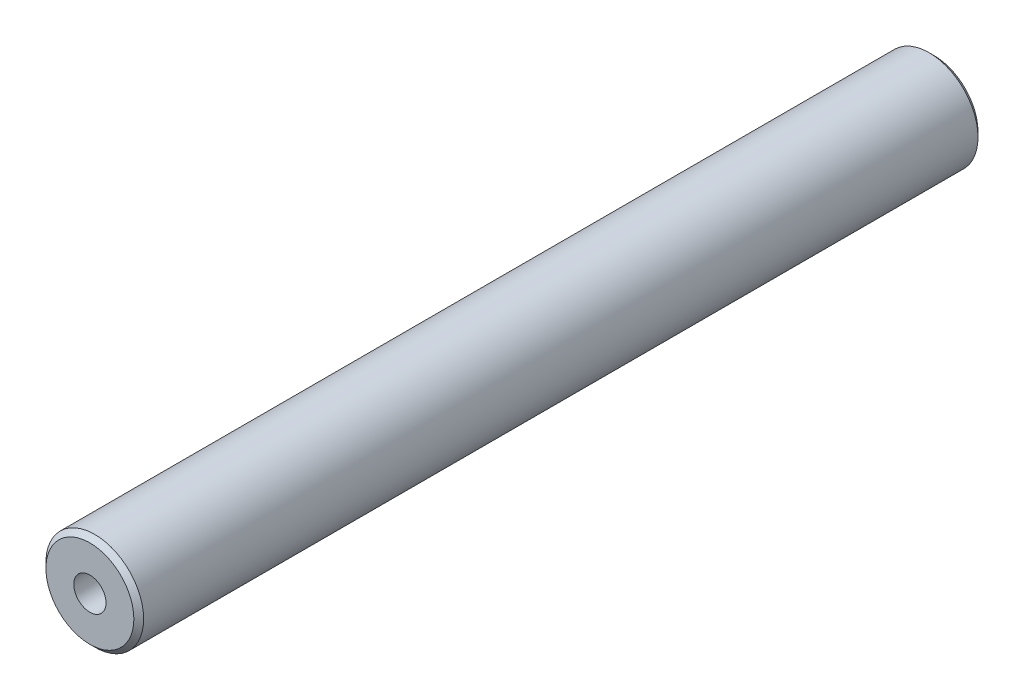
ISO-10303-21;
HEADER;
FILE_DESCRIPTION(('STEP AP214'),'2;1');
FILE_NAME('part.step','',(''),(''),'','','');
FILE_SCHEMA(('AUTOMOTIVE_DESIGN { 1 0 10303 214 1 1 1 1 }'));
ENDSEC;
DATA;
#1=APPLICATION_CONTEXT('core data for automotive mechanical design processes');
#2=APPLICATION_PROTOCOL_DEFINITION('international standard','automotive_design',2000,#1);
#3=PRODUCT_CONTEXT('',#1,'mechanical');
#4=PRODUCT('Part','Part','',(#3));
#5=PRODUCT_RELATED_PRODUCT_CATEGORY('part','',(#4));
#6=PRODUCT_DEFINITION_FORMATION('','',#4);
#7=PRODUCT_DEFINITION_CONTEXT('part definition',#1,'design');
#8=PRODUCT_DEFINITION('design','',#6,#7);
#9=PRODUCT_DEFINITION_SHAPE('','',#8);
#10=(LENGTH_UNIT() NAMED_UNIT(*) SI_UNIT(.MILLI.,.METRE.));
#11=(NAMED_UNIT(*) PLANE_ANGLE_UNIT() SI_UNIT($,.RADIAN.));
#12=(NAMED_UNIT(*) SI_UNIT($,.STERADIAN.) SOLID_ANGLE_UNIT());
#13=UNCERTAINTY_MEASURE_WITH_UNIT(LENGTH_MEASURE(1.E-05),#10,'distance_accuracy_value','');
#14=(GEOMETRIC_REPRESENTATION_CONTEXT(3) GLOBAL_UNCERTAINTY_ASSIGNED_CONTEXT((#13)) GLOBAL_UNIT_ASSIGNED_CONTEXT((#10,
#11,#12)) REPRESENTATION_CONTEXT('',''));
#15=CARTESIAN_POINT('',(0.,0.,0.));
#16=DIRECTION('',(0.,0.,1.));
#17=DIRECTION('',(1.,0.,0.));
#18=AXIS2_PLACEMENT_3D('',#15,#16,#17);
#19=CARTESIAN_POINT('',(0.,0.,86.4));
#20=DIRECTION('',(0.,0.,-1.));
#21=DIRECTION('',(-1.,0.,0.));
#22=AXIS2_PLACEMENT_3D('',#19,#20,#21);
#23=CYLINDRICAL_SURFACE('',#22,5.);
#24=CARTESIAN_POINT('',(0.,0.,85.9));
#25=DIRECTION('',(0.,0.,1.));
#26=DIRECTION('',(1.,0.,0.));
#27=AXIS2_PLACEMENT_3D('',#24,#25,#26);
#28=CIRCLE('',#27,5.);
#29=CARTESIAN_POINT('',(5.,0.,85.9));
#30=VERTEX_POINT('',#29);
#31=EDGE_CURVE('E50',#30,#30,#28,.F.);
#32=ORIENTED_EDGE('',*,*,#31,.T.);
#33=EDGE_LOOP('',(#32));
#34=FACE_BOUND('',#33,.T.);
#35=CARTESIAN_POINT('',(0.,0.,0.50000000000007));
#36=DIRECTION('',(0.,0.,1.));
#37=DIRECTION('',(1.,0.,0.));
#38=AXIS2_PLACEMENT_3D('',#35,#36,#37);
#39=CIRCLE('',#38,5.);
#40=CARTESIAN_POINT('',(5.,0.,0.50000000000007));
#41=VERTEX_POINT('',#40);
#42=EDGE_CURVE('E80',#41,#41,#39,.T.);
#43=ORIENTED_EDGE('',*,*,#42,.T.);
#44=EDGE_LOOP('',(#43));
#45=FACE_BOUND('',#44,.T.);
#46=ADVANCED_FACE('F41',(#34,#45),#23,.T.);
#47=CARTESIAN_POINT('',(0.,0.,86.4));
#48=DIRECTION('',(0.,0.,1.));
#49=DIRECTION('',(1.,0.,0.));
#50=AXIS2_PLACEMENT_3D('',#47,#48,#49);
#51=PLANE('',#50);
#52=CARTESIAN_POINT('',(0.,0.,86.4));
#53=DIRECTION('',(0.,0.,1.));
#54=DIRECTION('',(1.,0.,0.));
#55=AXIS2_PLACEMENT_3D('',#52,#53,#54);
#56=CIRCLE('',#55,4.50000000000003);
#57=CARTESIAN_POINT('',(4.50000000000003,0.,86.4));
#58=VERTEX_POINT('',#57);
#59=EDGE_CURVE('E77',#58,#58,#56,.T.);
#60=ORIENTED_EDGE('',*,*,#59,.T.);
#61=EDGE_LOOP('',(#60));
#62=FACE_BOUND('',#61,.T.);
#63=CARTESIAN_POINT('',(0.,0.,86.4));
#64=DIRECTION('',(0.,0.,1.));
#65=DIRECTION('',(1.,0.,0.));
#66=AXIS2_PLACEMENT_3D('',#63,#64,#65);
#67=CIRCLE('',#66,1.65);
#68=CARTESIAN_POINT('',(1.65,0.,86.4));
#69=VERTEX_POINT('',#68);
#70=EDGE_CURVE('E66',#69,#69,#67,.T.);
#71=ORIENTED_EDGE('',*,*,#70,.F.);
#72=EDGE_LOOP('',(#71));
#73=FACE_BOUND('',#72,.T.);
#74=ADVANCED_FACE('F92',(#62,#73),#51,.T.);
#75=CARTESIAN_POINT('',(0.,0.,0.));
#76=DIRECTION('',(0.,0.,1.));
#77=DIRECTION('',(1.,0.,0.));
#78=AXIS2_PLACEMENT_3D('',#75,#76,#77);
#79=PLANE('',#78);
#80=CARTESIAN_POINT('',(0.,0.,0.));
#81=DIRECTION('',(0.,0.,1.));
#82=DIRECTION('',(1.,0.,0.));
#83=AXIS2_PLACEMENT_3D('',#80,#81,#82);
#84=CIRCLE('',#83,4.49999999999992);
#85=CARTESIAN_POINT('',(4.49999999999992,0.,0.));
#86=VERTEX_POINT('',#85);
#87=EDGE_CURVE('E11',#86,#86,#84,.F.);
#88=ORIENTED_EDGE('',*,*,#87,.T.);
#89=EDGE_LOOP('',(#88));
#90=FACE_BOUND('',#89,.T.);
#91=CARTESIAN_POINT('',(0.,0.,0.));
#92=DIRECTION('',(0.,0.,-1.));
#93=DIRECTION('',(-1.,0.,0.));
#94=AXIS2_PLACEMENT_3D('',#91,#92,#93);
#95=CIRCLE('',#94,1.64999999999999);
#96=CARTESIAN_POINT('',(-1.64999999999999,0.,0.));
#97=VERTEX_POINT('',#96);
#98=EDGE_CURVE('E67',#97,#97,#95,.T.);
#99=ORIENTED_EDGE('',*,*,#98,.F.);
#100=EDGE_LOOP('',(#99));
#101=FACE_BOUND('',#100,.T.);
#102=ADVANCED_FACE('F95',(#90,#101),#79,.F.);
#103=CARTESIAN_POINT('',(0.,0.,66.4));
#104=DIRECTION('',(0.,0.,1.));
#105=DIRECTION('',(1.,0.,0.));
#106=AXIS2_PLACEMENT_3D('',#103,#104,#105);
#107=CONICAL_SURFACE('',#106,1.65,1.02974425867665);
#108=CARTESIAN_POINT('',(0.,0.,65.4085799786045));
#109=VERTEX_POINT('',#108);
#110=VERTEX_LOOP('',#109);
#111=FACE_BOUND('',#110,.T.);
#112=CARTESIAN_POINT('',(0.,0.,66.4));
#113=DIRECTION('',(0.,0.,1.));
#114=DIRECTION('',(1.,0.,0.));
#115=AXIS2_PLACEMENT_3D('',#112,#113,#114);
#116=CIRCLE('',#115,1.65);
#117=CARTESIAN_POINT('',(1.65,0.,66.4));
#118=VERTEX_POINT('',#117);
#119=EDGE_CURVE('E70',#118,#118,#116,.T.);
#120=ORIENTED_EDGE('',*,*,#119,.T.);
#121=EDGE_LOOP('',(#120));
#122=FACE_BOUND('',#121,.T.);
#123=ADVANCED_FACE('F100',(#111,#122),#107,.F.);
#124=CARTESIAN_POINT('',(0.,0.,86.4));
#125=DIRECTION('',(0.,0.,1.));
#126=DIRECTION('',(1.,0.,0.));
#127=AXIS2_PLACEMENT_3D('',#124,#125,#126);
#128=CYLINDRICAL_SURFACE('',#127,1.65);
#129=ORIENTED_EDGE('',*,*,#119,.F.);
#130=EDGE_LOOP('',(#129));
#131=FACE_BOUND('',#130,.T.);
#132=ORIENTED_EDGE('',*,*,#70,.T.);
#133=EDGE_LOOP('',(#132));
#134=FACE_BOUND('',#133,.T.);
#135=ADVANCED_FACE('F60',(#131,#134),#128,.F.);
#136=CARTESIAN_POINT('',(0.,0.,20.));
#137=DIRECTION('',(0.,0.,-1.));
#138=DIRECTION('',(-1.,0.,0.));
#139=AXIS2_PLACEMENT_3D('',#136,#137,#138);
#140=CONICAL_SURFACE('',#139,1.64999999999999,1.02974425867665);
#141=CARTESIAN_POINT('',(0.,0.,20.9914200213955));
#142=VERTEX_POINT('',#141);
#143=VERTEX_LOOP('',#142);
#144=FACE_BOUND('',#143,.T.);
#145=CARTESIAN_POINT('',(0.,0.,20.));
#146=DIRECTION('',(0.,0.,-1.));
#147=DIRECTION('',(-1.,0.,0.));
#148=AXIS2_PLACEMENT_3D('',#145,#146,#147);
#149=CIRCLE('',#148,1.64999999999999);
#150=CARTESIAN_POINT('',(-1.64999999999999,0.,20.));
#151=VERTEX_POINT('',#150);
#152=EDGE_CURVE('E64',#151,#151,#149,.T.);
#153=ORIENTED_EDGE('',*,*,#152,.T.);
#154=EDGE_LOOP('',(#153));
#155=FACE_BOUND('',#154,.T.);
#156=ADVANCED_FACE('F56',(#144,#155),#140,.F.);
#157=CARTESIAN_POINT('',(0.,0.,0.));
#158=DIRECTION('',(0.,0.,-1.));
#159=DIRECTION('',(-1.,0.,0.));
#160=AXIS2_PLACEMENT_3D('',#157,#158,#159);
#161=CYLINDRICAL_SURFACE('',#160,1.64999999999999);
#162=ORIENTED_EDGE('',*,*,#152,.F.);
#163=EDGE_LOOP('',(#162));
#164=FACE_BOUND('',#163,.T.);
#165=ORIENTED_EDGE('',*,*,#98,.T.);
#166=EDGE_LOOP('',(#165));
#167=FACE_BOUND('',#166,.T.);
#168=ADVANCED_FACE('F59',(#164,#167),#161,.F.);
#169=CARTESIAN_POINT('',(0.,0.,86.4));
#170=DIRECTION('',(0.,0.,-1.));
#171=DIRECTION('',(-1.,0.,0.));
#172=AXIS2_PLACEMENT_3D('',#169,#170,#171);
#173=CONICAL_SURFACE('',#172,4.50000000000003,0.78539816339746);
#174=ORIENTED_EDGE('',*,*,#31,.F.);
#175=EDGE_LOOP('',(#174));
#176=FACE_BOUND('',#175,.T.);
#177=ORIENTED_EDGE('',*,*,#59,.F.);
#178=EDGE_LOOP('',(#177));
#179=FACE_BOUND('',#178,.T.);
#180=ADVANCED_FACE('F87',(#176,#179),#173,.T.);
#181=CARTESIAN_POINT('',(0.,0.,0.50000000000007));
#182=DIRECTION('',(0.,0.,1.));
#183=DIRECTION('',(1.,0.,0.));
#184=AXIS2_PLACEMENT_3D('',#181,#182,#183);
#185=CONICAL_SURFACE('',#184,5.,0.78539816339746);
#186=ORIENTED_EDGE('',*,*,#87,.F.);
#187=EDGE_LOOP('',(#186));
#188=FACE_BOUND('',#187,.T.);
#189=ORIENTED_EDGE('',*,*,#42,.F.);
#190=EDGE_LOOP('',(#189));
#191=FACE_BOUND('',#190,.T.);
#192=ADVANCED_FACE('F44',(#188,#191),#185,.T.);
#193=CLOSED_SHELL('',(#46,#74,#102,#123,#135,#156,#168,#180,#192));
#194=MANIFOLD_SOLID_BREP('B2',#193);
#195=ADVANCED_BREP_SHAPE_REPRESENTATION('',(#18,#194),#14);
#196=SHAPE_DEFINITION_REPRESENTATION(#9,#195);
ENDSEC;
END-ISO-10303-21;
